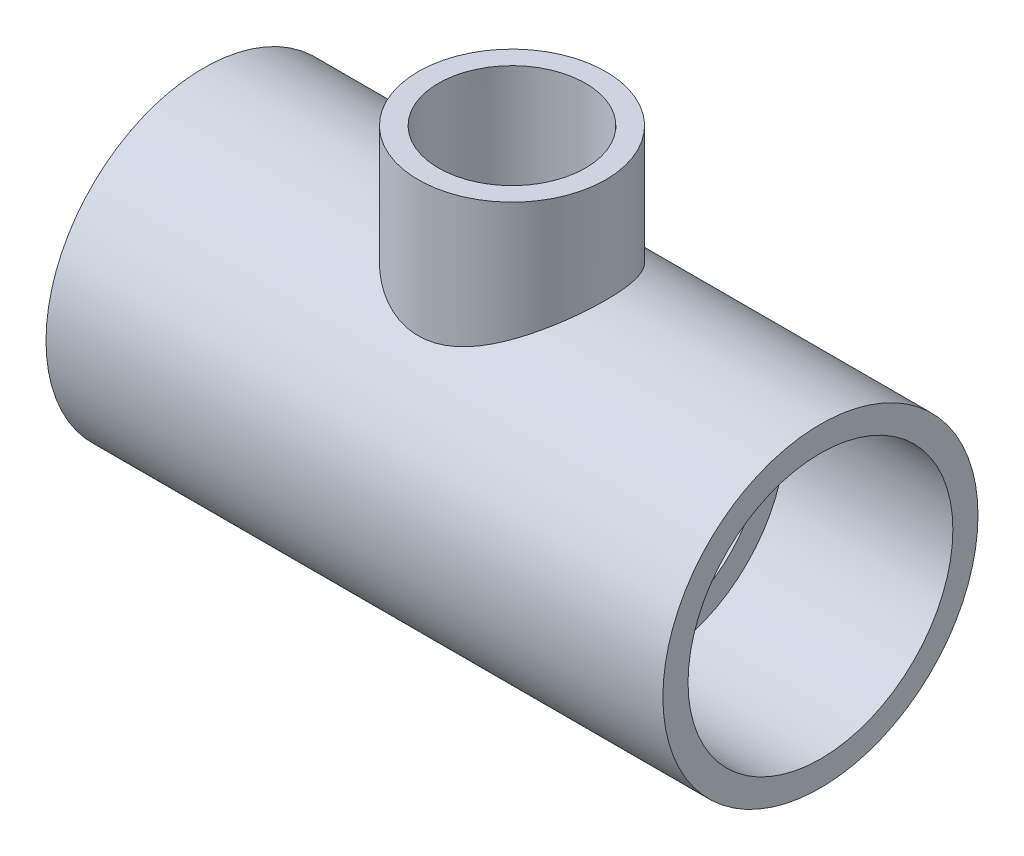
ISO-10303-21;
HEADER;
FILE_DESCRIPTION(('STEP AP214'),'2;1');
FILE_NAME('part.step','',(''),(''),'','','');
FILE_SCHEMA(('AUTOMOTIVE_DESIGN { 1 0 10303 214 1 1 1 1 }'));
ENDSEC;
DATA;
#1=APPLICATION_CONTEXT('core data for automotive mechanical design processes');
#2=APPLICATION_PROTOCOL_DEFINITION('international standard','automotive_design',2000,#1);
#3=PRODUCT_CONTEXT('',#1,'mechanical');
#4=PRODUCT('Part','Part','',(#3));
#5=PRODUCT_RELATED_PRODUCT_CATEGORY('part','',(#4));
#6=PRODUCT_DEFINITION_FORMATION('','',#4);
#7=PRODUCT_DEFINITION_CONTEXT('part definition',#1,'design');
#8=PRODUCT_DEFINITION('design','',#6,#7);
#9=PRODUCT_DEFINITION_SHAPE('','',#8);
#10=(LENGTH_UNIT() NAMED_UNIT(*) SI_UNIT(.MILLI.,.METRE.));
#11=(NAMED_UNIT(*) PLANE_ANGLE_UNIT() SI_UNIT($,.RADIAN.));
#12=(NAMED_UNIT(*) SI_UNIT($,.STERADIAN.) SOLID_ANGLE_UNIT());
#13=UNCERTAINTY_MEASURE_WITH_UNIT(LENGTH_MEASURE(1.E-05),#10,'distance_accuracy_value','');
#14=(GEOMETRIC_REPRESENTATION_CONTEXT(3) GLOBAL_UNCERTAINTY_ASSIGNED_CONTEXT((#13)) GLOBAL_UNIT_ASSIGNED_CONTEXT((#10,
#11,#12)) REPRESENTATION_CONTEXT('',''));
#15=CARTESIAN_POINT('',(0.,0.,0.));
#16=DIRECTION('',(0.,0.,1.));
#17=DIRECTION('',(1.,0.,0.));
#18=AXIS2_PLACEMENT_3D('',#15,#16,#17);
#19=CARTESIAN_POINT('',(-32.512,0.,0.));
#20=DIRECTION('',(1.,0.,0.));
#21=DIRECTION('',(0.,0.,-1.));
#22=AXIS2_PLACEMENT_3D('',#19,#20,#21);
#23=PLANE('',#22);
#24=CARTESIAN_POINT('',(-32.512,0.,0.));
#25=DIRECTION('',(-1.,0.,0.));
#26=DIRECTION('',(0.,0.,1.));
#27=AXIS2_PLACEMENT_3D('',#24,#25,#26);
#28=CIRCLE('',#27,30.0863);
#29=CARTESIAN_POINT('',(-32.512,0.,30.0863));
#30=VERTEX_POINT('',#29);
#31=EDGE_CURVE('E92',#30,#30,#28,.T.);
#32=ORIENTED_EDGE('',*,*,#31,.T.);
#33=EDGE_LOOP('',(#32));
#34=FACE_BOUND('',#33,.T.);
#35=CARTESIAN_POINT('',(-32.512,0.,0.));
#36=DIRECTION('',(1.,0.,0.));
#37=DIRECTION('',(0.,0.,-1.));
#38=AXIS2_PLACEMENT_3D('',#35,#36,#37);
#39=CIRCLE('',#38,24.6253);
#40=CARTESIAN_POINT('',(-32.512,0.,-24.6253));
#41=VERTEX_POINT('',#40);
#42=EDGE_CURVE('E95',#41,#41,#39,.T.);
#43=ORIENTED_EDGE('',*,*,#42,.T.);
#44=EDGE_LOOP('',(#43));
#45=FACE_BOUND('',#44,.T.);
#46=ADVANCED_FACE('F30',(#34,#45),#23,.F.);
#47=CARTESIAN_POINT('',(32.512,0.,0.));
#48=DIRECTION('',(1.,0.,0.));
#49=DIRECTION('',(0.,0.,-1.));
#50=AXIS2_PLACEMENT_3D('',#47,#48,#49);
#51=PLANE('',#50);
#52=CARTESIAN_POINT('',(32.512,0.,0.));
#53=DIRECTION('',(1.,0.,0.));
#54=DIRECTION('',(0.,0.,-1.));
#55=AXIS2_PLACEMENT_3D('',#52,#53,#54);
#56=CIRCLE('',#55,30.0863);
#57=CARTESIAN_POINT('',(32.512,0.,-30.0863));
#58=VERTEX_POINT('',#57);
#59=EDGE_CURVE('E10',#58,#58,#56,.F.);
#60=ORIENTED_EDGE('',*,*,#59,.F.);
#61=EDGE_LOOP('',(#60));
#62=FACE_BOUND('',#61,.T.);
#63=CARTESIAN_POINT('',(32.512,0.,0.));
#64=DIRECTION('',(1.,0.,0.));
#65=DIRECTION('',(0.,0.,-1.));
#66=AXIS2_PLACEMENT_3D('',#63,#64,#65);
#67=CIRCLE('',#66,24.6253);
#68=CARTESIAN_POINT('',(32.512,0.,-24.6253));
#69=VERTEX_POINT('',#68);
#70=EDGE_CURVE('E98',#69,#69,#67,.T.);
#71=ORIENTED_EDGE('',*,*,#70,.F.);
#72=EDGE_LOOP('',(#71));
#73=FACE_BOUND('',#72,.T.);
#74=ADVANCED_FACE('F68',(#62,#73),#51,.T.);
#75=CARTESIAN_POINT('',(32.512,0.,0.));
#76=DIRECTION('',(-1.,0.,0.));
#77=DIRECTION('',(0.,0.,1.));
#78=AXIS2_PLACEMENT_3D('',#75,#76,#77);
#79=CYLINDRICAL_SURFACE('',#78,36.068);
#80=CARTESIAN_POINT('',(-70.612,0.,0.));
#81=DIRECTION('',(-1.,0.,0.));
#82=DIRECTION('',(0.,0.,1.));
#83=AXIS2_PLACEMENT_3D('',#80,#81,#82);
#84=CIRCLE('',#83,36.068);
#85=CARTESIAN_POINT('',(-70.612,0.,36.068));
#86=VERTEX_POINT('',#85);
#87=EDGE_CURVE('E109',#86,#86,#84,.T.);
#88=ORIENTED_EDGE('',*,*,#87,.F.);
#89=EDGE_LOOP('',(#88));
#90=FACE_BOUND('',#89,.T.);
#91=CARTESIAN_POINT('',(70.612,0.,0.));
#92=DIRECTION('',(-1.,0.,0.));
#93=DIRECTION('',(0.,0.,1.));
#94=AXIS2_PLACEMENT_3D('',#91,#92,#93);
#95=CIRCLE('',#94,36.068);
#96=CARTESIAN_POINT('',(70.612,0.,36.068));
#97=VERTEX_POINT('',#96);
#98=EDGE_CURVE('E97',#97,#97,#95,.T.);
#99=ORIENTED_EDGE('',*,*,#98,.T.);
#100=EDGE_LOOP('',(#99));
#101=FACE_BOUND('',#100,.T.);
#102=CARTESIAN_POINT('',(21.463,36.068,0.));
#103=CARTESIAN_POINT('',(21.4629955012336,36.0679958333885,-0.549955186499196));
#104=CARTESIAN_POINT('',(21.4418286946014,36.055389158431,-1.10007080613266));
#105=CARTESIAN_POINT('',(21.3574273305565,36.0052612434909,-2.1961634067197));
#106=CARTESIAN_POINT('',(21.294166931655,35.9677246989503,-2.74213763688238));
#107=CARTESIAN_POINT('',(21.1262441488934,35.8685634583346,-3.8267436334737));
#108=CARTESIAN_POINT('',(21.0214879454157,35.8068841807053,-4.36535588019342));
#109=CARTESIAN_POINT('',(20.7719652680935,35.6609669938344,-5.42998711952681));
#110=CARTESIAN_POINT('',(20.6272045523225,35.5767323311699,-5.95600791266776));
#111=CARTESIAN_POINT('',(20.3002147275364,35.3881510151928,-6.98956407610863));
#112=CARTESIAN_POINT('',(20.11817542982,35.2839064086569,-7.49717833179165));
#113=CARTESIAN_POINT('',(19.7181061781887,35.0573357779405,-8.4938236271323));
#114=CARTESIAN_POINT('',(19.5000750619621,34.9350091698372,-8.98285406602064));
#115=CARTESIAN_POINT('',(19.0301303524284,34.6748877511424,-9.93974477144127));
#116=CARTESIAN_POINT('',(18.7782319940875,34.537099900277,-10.4076144312737));
#117=CARTESIAN_POINT('',(18.2424225324483,34.248726267441,-11.3205381463891));
#118=CARTESIAN_POINT('',(17.9585081587997,34.09813917845,-11.7655898641136));
#119=CARTESIAN_POINT('',(17.3378828067172,33.7752418914906,-12.6640611369192));
#120=CARTESIAN_POINT('',(16.9988019540272,33.6021502073395,-13.1155629319043));
#121=CARTESIAN_POINT('',(16.2878537641754,33.2481487366544,-13.9886807783063));
#122=CARTESIAN_POINT('',(15.915985005189,33.0672386112528,-14.4102955322609));
#123=CARTESIAN_POINT('',(15.1408577335427,32.7012074758686,-15.222692767102));
#124=CARTESIAN_POINT('',(14.7375622391471,32.5160816919732,-15.6134377992391));
#125=CARTESIAN_POINT('',(13.9016081493236,32.1458321409871,-16.3621684571544));
#126=CARTESIAN_POINT('',(13.4689479796909,31.9607083745376,-16.7201523242262));
#127=CARTESIAN_POINT('',(12.5219847775636,31.5726466066888,-17.4429484827564));
#128=CARTESIAN_POINT('',(12.0041216347177,31.3702447153127,-17.8034013560292));
#129=CARTESIAN_POINT('',(10.9353739342683,30.9770204773409,-18.4791153571752));
#130=CARTESIAN_POINT('',(10.3844840804206,30.7861999978954,-18.7943692091844));
#131=CARTESIAN_POINT('',(9.25279599288201,30.4231439624148,-19.3765452159325));
#132=CARTESIAN_POINT('',(8.67203776614753,30.2508844559043,-19.6435299647606));
#133=CARTESIAN_POINT('',(7.48304605482125,29.9317355681574,-20.1264932056783));
#134=CARTESIAN_POINT('',(6.87482270274245,29.7848369256409,-20.3424903280582));
#135=CARTESIAN_POINT('',(5.78267766596031,29.5544638875913,-20.6752239510991));
#136=CARTESIAN_POINT('',(5.30362843446786,29.4642156072466,-20.8033494515604));
#137=CARTESIAN_POINT('',(4.33440470717605,29.3052722481931,-21.0266612249542));
#138=CARTESIAN_POINT('',(3.84423192592826,29.2365738717188,-21.1218525380103));
#139=CARTESIAN_POINT('',(2.85622119516374,29.1231476121112,-21.2779753420956));
#140=CARTESIAN_POINT('',(2.35839172168037,29.0783949450757,-21.3389422587331));
#141=CARTESIAN_POINT('',(1.35802339347409,29.0143994566346,-21.425876631228));
#142=CARTESIAN_POINT('',(0.855484455182277,28.9951570887727,-21.4518434648244));
#143=CARTESIAN_POINT('',(-0.151431251739087,28.982913852612,-21.4683823726771));
#144=CARTESIAN_POINT('',(-0.655809700367673,28.989961652283,-21.4588888031155));
#145=CARTESIAN_POINT('',(-1.6615979173613,29.0301331266113,-21.4045116445106));
#146=CARTESIAN_POINT('',(-2.16300767166571,29.063256924673,-21.3596278879836));
#147=CARTESIAN_POINT('',(-3.15950369915439,29.1543533587243,-21.2351176664531));
#148=CARTESIAN_POINT('',(-3.65458576194051,29.2123417347304,-21.1554691937777));
#149=CARTESIAN_POINT('',(-4.63487269138145,29.3510951647059,-20.9625359174924));
#150=CARTESIAN_POINT('',(-5.12007732769605,29.4318607491859,-20.8492503304276));
#151=CARTESIAN_POINT('',(-6.07236571345055,29.6124596696406,-20.5919215482617));
#152=CARTESIAN_POINT('',(-6.53959406582468,29.7120618951429,-20.4482488813037));
#153=CARTESIAN_POINT('',(-7.45987633545462,29.9280772014045,-20.1307642233393));
#154=CARTESIAN_POINT('',(-7.91292448054736,30.0444970223462,-19.9569401425673));
#155=CARTESIAN_POINT('',(-8.80303782018458,30.291101223135,-19.5806126441224));
#156=CARTESIAN_POINT('',(-9.24010312459196,30.4212855083441,-19.3781094236308));
#157=CARTESIAN_POINT('',(-10.0970318215879,30.6924266021064,-18.9457302598338));
#158=CARTESIAN_POINT('',(-10.5168931325322,30.8333847083899,-18.7158510171599));
#159=CARTESIAN_POINT('',(-11.4091861183347,31.14814133043,-18.1880145139731));
#160=CARTESIAN_POINT('',(-11.8782033736991,31.3234122605326,-17.8851528409649));
#161=CARTESIAN_POINT('',(-12.7896809731185,31.6802823782936,-17.2451326383963));
#162=CARTESIAN_POINT('',(-13.2321390258581,31.8618821098203,-16.9079711564654));
#163=CARTESIAN_POINT('',(-14.0894414521855,32.2273508370409,-16.2005279995394));
#164=CARTESIAN_POINT('',(-14.5042619553269,32.4112216358719,-15.830218325177));
#165=CARTESIAN_POINT('',(-15.3043706957407,32.7770871359483,-15.0580787382223));
#166=CARTESIAN_POINT('',(-15.6896573263291,32.9590817346603,-14.6562471131943));
#167=CARTESIAN_POINT('',(-16.4789068639499,33.3415640264684,-13.7661136694631));
#168=CARTESIAN_POINT('',(-16.8783774662731,33.5412343963679,-13.2734596307647));
#169=CARTESIAN_POINT('',(-17.6342792805926,33.9279029608686,-12.2513910107686));
#170=CARTESIAN_POINT('',(-17.9907060590766,34.1148998492329,-11.7219726515776));
#171=CARTESIAN_POINT('',(-18.6571508326299,34.4710056629587,-10.6292255581115));
#172=CARTESIAN_POINT('',(-18.9671867302025,34.6401214812963,-10.0659100232326));
#173=CARTESIAN_POINT('',(-19.5375041269635,34.95565596253,-8.9085532901237));
#174=CARTESIAN_POINT('',(-19.7977918221917,35.1020774515298,-8.31451592996111));
#175=CARTESIAN_POINT('',(-20.2500694299667,35.3592030837919,-7.1390285064387));
#176=CARTESIAN_POINT('',(-20.4453750337001,35.4715986199873,-6.55922567231934));
#177=CARTESIAN_POINT('',(-20.7866366402843,35.6693868011161,-5.38073619207309));
#178=CARTESIAN_POINT('',(-20.9325941382699,35.7547802641456,-4.78205011866616));
#179=CARTESIAN_POINT('',(-21.1727406332251,35.8959017718609,-3.57152756669138));
#180=CARTESIAN_POINT('',(-21.2669795482166,35.9516584199271,-2.95970436282403));
#181=CARTESIAN_POINT('',(-21.402272412241,36.0318541567467,-1.72819635868767));
#182=CARTESIAN_POINT('',(-21.4433335558085,36.0562974819419,-1.10851263334317));
#183=CARTESIAN_POINT('',(-21.4696834285792,36.0719772778071,0.049618098403805));
#184=CARTESIAN_POINT('',(-21.4616824349449,36.0672091217748,0.587872694205228));
#185=CARTESIAN_POINT('',(-21.4053434734274,36.033712718609,1.66147516389867));
#186=CARTESIAN_POINT('',(-21.3570098345406,36.004987042892,2.19682334353655));
#187=CARTESIAN_POINT('',(-21.2206569043275,35.924274909156,3.2606276273093));
#188=CARTESIAN_POINT('',(-21.1326386081918,35.872289034444,3.78908390393369));
#189=CARTESIAN_POINT('',(-20.9180373557849,35.7462865519787,4.83542344278839));
#190=CARTESIAN_POINT('',(-20.7914533987002,35.6722693724945,5.35330643026019));
#191=CARTESIAN_POINT('',(-20.5043839638669,35.505727200392,6.364006604679));
#192=CARTESIAN_POINT('',(-20.3446977001994,35.4136408557728,6.85712410756646));
#193=CARTESIAN_POINT('',(-19.9914891475949,35.2119139344019,7.82734069640484));
#194=CARTESIAN_POINT('',(-19.7979678212225,35.1022738570391,8.30444023758631));
#195=CARTESIAN_POINT('',(-19.3788072514427,34.8675819749626,9.24041003088048));
#196=CARTESIAN_POINT('',(-19.1531650297491,34.7425287412679,9.69927858754332));
#197=CARTESIAN_POINT('',(-18.6715259411434,34.4793483428168,10.5968843247397));
#198=CARTESIAN_POINT('',(-18.4155271948274,34.3412203686967,11.0356202565069));
#199=CARTESIAN_POINT('',(-17.8467377638358,34.0394224073497,11.9359357804971));
#200=CARTESIAN_POINT('',(-17.5308095546475,33.8745900838003,12.3951448690397));
#201=CARTESIAN_POINT('',(-16.8661343170436,33.5354297034058,13.2854261583916));
#202=CARTESIAN_POINT('',(-16.517385372552,33.3611010924176,13.7164967139808));
#203=CARTESIAN_POINT('',(-15.7885793334125,33.006333508074,14.5494920493151));
#204=CARTESIAN_POINT('',(-15.4084891698965,32.8258882021465,14.9513851806067));
#205=CARTESIAN_POINT('',(-14.6190002679547,32.4627872472857,15.7241971946871));
#206=CARTESIAN_POINT('',(-14.2096000998588,32.2801314908937,16.0951145646401));
#207=CARTESIAN_POINT('',(-13.3090556372117,31.8933447541626,16.8498396075202));
#208=CARTESIAN_POINT('',(-12.8141397725937,31.6894399770902,17.2292773606304));
#209=CARTESIAN_POINT('',(-11.7908701077896,31.2896639482552,17.9450735899609));
#210=CARTESIAN_POINT('',(-11.2625110292388,31.0937939727112,18.2814252404144));
#211=CARTESIAN_POINT('',(-10.1749547656833,30.7166093543593,18.9083117391331));
#212=CARTESIAN_POINT('',(-9.61578509915038,30.5352820671655,19.1988866055344));
#213=CARTESIAN_POINT('',(-8.46875770780185,30.193720133927,19.7317027506019));
#214=CARTESIAN_POINT('',(-7.88090883555296,30.0334790348566,19.973958828071));
#215=CARTESIAN_POINT('',(-6.80974652642561,29.7725453662256,20.3602094057861));
#216=CARTESIAN_POINT('',(-6.33130419536744,29.6664680857042,20.5141246710921));
#217=CARTESIAN_POINT('',(-5.36100339254714,29.4746434754775,20.7887979772916));
#218=CARTESIAN_POINT('',(-4.86914675050901,29.3888933884363,20.9095605156258));
#219=CARTESIAN_POINT('',(-3.8752977497791,29.2406753387526,21.1163382466108));
#220=CARTESIAN_POINT('',(-3.37331769707593,29.1781807162311,21.2023932372691));
#221=CARTESIAN_POINT('',(-2.36198810748157,29.0786193395933,21.3387367821393));
#222=CARTESIAN_POINT('',(-1.85263851458,29.0415527788406,21.3890250643692));
#223=CARTESIAN_POINT('',(-0.828613236838667,28.9942131601922,21.4531547129083));
#224=CARTESIAN_POINT('',(-0.313925206111073,28.98403348246,21.4668690567775));
#225=CARTESIAN_POINT('',(0.714912873702352,28.9911492358534,21.4572580151905));
#226=CARTESIAN_POINT('',(1.22906292149078,29.0084447330865,21.4339325406135));
#227=CARTESIAN_POINT('',(2.25300130085473,29.0698282364911,21.3506056109514));
#228=CARTESIAN_POINT('',(2.76278734862744,29.1139294939753,21.2905860161997));
#229=CARTESIAN_POINT('',(3.77400242770924,29.2272278534621,21.1347820484505));
#230=CARTESIAN_POINT('',(4.27543140144109,29.2964251282928,21.0389974291512));
#231=CARTESIAN_POINT('',(5.24551218550072,29.4539702821916,20.8178249048167));
#232=CARTESIAN_POINT('',(5.71464891805822,29.5413732373454,20.6938772507416));
#233=CARTESIAN_POINT('',(6.64018581174673,29.7342791098689,20.4157266738785));
#234=CARTESIAN_POINT('',(7.09658178407147,29.8397879003117,20.2615139315256));
#235=CARTESIAN_POINT('',(7.99469720969075,30.0660358704942,19.9242394437308));
#236=CARTESIAN_POINT('',(8.43641564795647,30.1867761008102,19.7411757080973));
#237=CARTESIAN_POINT('',(9.30374298054277,30.4405630141982,19.3475470625314));
#238=CARTESIAN_POINT('',(9.72935115251858,30.573610248167,19.1369809213381));
#239=CARTESIAN_POINT('',(10.6277745373016,30.8704283688958,18.6550056825655));
#240=CARTESIAN_POINT('',(11.0977274818961,31.0357706348589,18.3792224338459));
#241=CARTESIAN_POINT('',(12.0131310250016,31.374747716891,17.7943825160109));
#242=CARTESIAN_POINT('',(12.4585853887466,31.5483812509522,17.4853309816764));
#243=CARTESIAN_POINT('',(13.3241539833599,31.9001070637685,16.8350977254087));
#244=CARTESIAN_POINT('',(13.7442470500341,32.078202895671,16.4938897605097));
#245=CARTESIAN_POINT('',(14.5573771249832,32.4349194202356,15.7808611302418));
#246=CARTESIAN_POINT('',(14.9504124744838,32.6135401443776,15.4090385911087));
#247=CARTESIAN_POINT('',(15.7673258348228,32.9954356441719,14.5754440502826));
#248=CARTESIAN_POINT('',(16.1863972148686,33.1981915182252,14.1087037907338));
#249=CARTESIAN_POINT('',(16.9838849397354,33.5942379795887,13.1378346644038));
#250=CARTESIAN_POINT('',(17.3622964292492,33.787527434992,12.633701344539));
#251=CARTESIAN_POINT('',(18.0756684678211,34.1595871176714,11.5900910915508));
#252=CARTESIAN_POINT('',(18.4106089196763,34.3383506152371,11.0505979833897));
#253=CARTESIAN_POINT('',(19.0335327059023,34.6763200141136,9.93934565528037));
#254=CARTESIAN_POINT('',(19.321522272397,34.8355285104054,9.36759073125615));
#255=CARTESIAN_POINT('',(19.8377000395127,35.1245004361445,8.21641669491277));
#256=CARTESIAN_POINT('',(20.0676638151183,35.2551156940327,7.63800944828328));
#257=CARTESIAN_POINT('',(20.4777628810792,35.4901501968142,6.45843868565022));
#258=CARTESIAN_POINT('',(20.6578897416052,35.5945650096691,5.85727133934104));
#259=CARTESIAN_POINT('',(20.9649676139029,35.7736581311565,4.63935791016681));
#260=CARTESIAN_POINT('',(21.0920951010935,35.8484350851977,4.0226708976899));
#261=CARTESIAN_POINT('',(21.2917908643984,35.9662904914895,2.77789432053145));
#262=CARTESIAN_POINT('',(21.3644055694982,36.0093959179738,2.14981492691807));
#263=CARTESIAN_POINT('',(21.4270916403961,36.0466417204811,1.26665693209297));
#264=CARTESIAN_POINT('',(21.4405511678771,36.0546452483863,1.01359728521445));
#265=CARTESIAN_POINT('',(21.4585065023745,36.0653254185212,0.507036465507004));
#266=CARTESIAN_POINT('',(21.4630020739799,36.0680019208529,0.253535281257442));
#267=CARTESIAN_POINT('',(21.463,36.068,0.));
#268=B_SPLINE_CURVE_WITH_KNOTS('',3,(#102,#103,#104,#105,#106,#107,#108,#109,#110,#111,#112,
#113,#114,#115,#116,#117,#118,#119,#120,#121,#122,#123,#124,#125,#126,#127,#128,#129,#130,#131,
#132,#133,#134,#135,#136,#137,#138,#139,#140,#141,#142,#143,#144,#145,#146,#147,#148,#149,#150,
#151,#152,#153,#154,#155,#156,#157,#158,#159,#160,#161,#162,#163,#164,#165,#166,#167,#168,#169,
#170,#171,#172,#173,#174,#175,#176,#177,#178,#179,#180,#181,#182,#183,#184,#185,#186,#187,#188,
#189,#190,#191,#192,#193,#194,#195,#196,#197,#198,#199,#200,#201,#202,#203,#204,#205,#206,#207,
#208,#209,#210,#211,#212,#213,#214,#215,#216,#217,#218,#219,#220,#221,#222,#223,#224,#225,#226,
#227,#228,#229,#230,#231,#232,#233,#234,#235,#236,#237,#238,#239,#240,#241,#242,#243,#244,#245,
#246,#247,#248,#249,#250,#251,#252,#253,#254,#255,#256,#257,#258,#259,#260,#261,#262,#263,#264,
#265,#266,#267),.UNSPECIFIED.,.T.,.F.,(4,2,2,2,2,2,2,2,2,2,2,2,2,2,2,2,2,2,2,2,2,2,2,2,2,2,2,2,
2,2,2,2,2,2,2,2,2,2,2,2,2,2,2,2,2,2,2,2,2,2,2,2,2,2,2,2,2,2,2,2,2,2,2,2,2,2,2,2,2,2,2,2,2,2,2,2,
2,2,2,2,2,2,4),(0.,1.64959642123134,3.30020647428807,4.95456995953005,6.60869544688477,
8.25459917957968,9.90055607512477,11.545775009297,13.1911621506759,14.9611285437609,
16.731171727984,18.5033302309237,20.2755838123023,22.2610417990428,24.246819034782,
26.2300024023474,28.212460012047,29.7230441594288,31.2333970303623,32.7421836414886,
34.2509970767413,35.7626049900595,37.2742200570911,38.7867934373493,40.2994020502981,
41.7945325471141,43.2902639357673,44.7859850411254,46.281886594135,48.0356577730855,
49.7895800365629,51.5449980273508,53.3005114476708,55.2928494841009,57.2853925565682,
59.2771647011972,61.2686886126699,63.1321403432166,64.9955356103733,66.8571291782575,
68.7184708608382,70.3314703923341,71.9442968191064,73.5570828025289,75.1699106427546,
76.747578706329,78.3252018945486,79.902971457188,81.4808387522245,83.2228244603146,
84.9649119287718,86.7088616312856,88.4528964574088,90.4189475978552,92.3853098189701,
94.3499433883025,96.3139743137692,97.853458195715,99.3927331306662,100.930237976762,
102.467754514431,104.010603983338,105.553457164467,107.097073669463,108.640700805032,
110.118351844899,111.596483106396,113.074716376611,114.553015848855,116.259649144078,
117.966019406294,119.673794505045,121.381674205941,123.356970202516,125.332501812988,
127.308943507521,129.285122640953,131.19036352073,133.095926472014,134.995092667564,
136.892639486728,137.653101283912,138.413583052037),.UNSPECIFIED.);
#269=CARTESIAN_POINT('',(21.463,36.068,0.));
#270=VERTEX_POINT('',#269);
#271=EDGE_CURVE('E52',#270,#270,#268,.T.);
#272=ORIENTED_EDGE('',*,*,#271,.F.);
#273=EDGE_LOOP('',(#272));
#274=FACE_BOUND('',#273,.T.);
#275=ADVANCED_FACE('F64',(#90,#101,#274),#79,.T.);
#276=CARTESIAN_POINT('',(0.,0.,0.));
#277=DIRECTION('',(0.,-1.,0.));
#278=DIRECTION('',(1.,0.,0.));
#279=AXIS2_PLACEMENT_3D('',#276,#277,#278);
#280=CYLINDRICAL_SURFACE('',#279,21.463);
#281=CARTESIAN_POINT('',(0.,59.944,0.));
#282=DIRECTION('',(0.,-1.,0.));
#283=DIRECTION('',(1.,0.,0.));
#284=AXIS2_PLACEMENT_3D('',#281,#282,#283);
#285=CIRCLE('',#284,21.463);
#286=CARTESIAN_POINT('',(21.463,59.944,0.));
#287=VERTEX_POINT('',#286);
#288=EDGE_CURVE('E43',#287,#287,#285,.T.);
#289=ORIENTED_EDGE('',*,*,#288,.T.);
#290=EDGE_LOOP('',(#289));
#291=FACE_BOUND('',#290,.T.);
#292=ORIENTED_EDGE('',*,*,#271,.T.);
#293=EDGE_LOOP('',(#292));
#294=FACE_BOUND('',#293,.T.);
#295=ADVANCED_FACE('F61',(#291,#294),#280,.T.);
#296=CARTESIAN_POINT('',(0.,59.944,0.));
#297=DIRECTION('',(0.,1.,0.));
#298=DIRECTION('',(-1.,0.,0.));
#299=AXIS2_PLACEMENT_3D('',#296,#297,#298);
#300=CONICAL_SURFACE('',#299,16.8275,0.00666656790386822);
#301=CARTESIAN_POINT('',(0.,59.944,0.));
#302=DIRECTION('',(0.,-1.,0.));
#303=DIRECTION('',(1.,0.,0.));
#304=AXIS2_PLACEMENT_3D('',#301,#302,#303);
#305=CIRCLE('',#304,16.8275);
#306=CARTESIAN_POINT('',(16.8275,59.944,0.));
#307=VERTEX_POINT('',#306);
#308=EDGE_CURVE('E47',#307,#307,#305,.T.);
#309=ORIENTED_EDGE('',*,*,#308,.F.);
#310=EDGE_LOOP('',(#309));
#311=FACE_BOUND('',#310,.T.);
#312=CARTESIAN_POINT('',(0.,31.369,0.));
#313=DIRECTION('',(0.,-1.,0.));
#314=DIRECTION('',(1.,0.,0.));
#315=AXIS2_PLACEMENT_3D('',#312,#313,#314);
#316=CIRCLE('',#315,16.637);
#317=CARTESIAN_POINT('',(16.637,31.369,0.));
#318=VERTEX_POINT('',#317);
#319=EDGE_CURVE('E152',#318,#318,#316,.T.);
#320=ORIENTED_EDGE('',*,*,#319,.T.);
#321=EDGE_LOOP('',(#320));
#322=FACE_BOUND('',#321,.T.);
#323=ADVANCED_FACE('F71',(#311,#322),#300,.F.);
#324=CARTESIAN_POINT('',(21.463,59.944,0.));
#325=DIRECTION('',(0.,1.,0.));
#326=DIRECTION('',(-1.,0.,0.));
#327=AXIS2_PLACEMENT_3D('',#324,#325,#326);
#328=PLANE('',#327);
#329=ORIENTED_EDGE('',*,*,#308,.T.);
#330=EDGE_LOOP('',(#329));
#331=FACE_BOUND('',#330,.T.);
#332=ORIENTED_EDGE('',*,*,#288,.F.);
#333=EDGE_LOOP('',(#332));
#334=FACE_BOUND('',#333,.T.);
#335=ADVANCED_FACE('F32',(#331,#334),#328,.T.);
#336=CARTESIAN_POINT('',(-70.612,-36.068,0.));
#337=DIRECTION('',(-1.,0.,0.));
#338=DIRECTION('',(0.,0.,1.));
#339=AXIS2_PLACEMENT_3D('',#336,#337,#338);
#340=PLANE('',#339);
#341=ORIENTED_EDGE('',*,*,#87,.T.);
#342=EDGE_LOOP('',(#341));
#343=FACE_BOUND('',#342,.T.);
#344=CARTESIAN_POINT('',(-70.612,0.,0.));
#345=DIRECTION('',(-1.,0.,0.));
#346=DIRECTION('',(0.,0.,1.));
#347=AXIS2_PLACEMENT_3D('',#344,#345,#346);
#348=CIRCLE('',#347,30.3149);
#349=CARTESIAN_POINT('',(-70.612,0.,30.3149));
#350=VERTEX_POINT('',#349);
#351=EDGE_CURVE('E59',#350,#350,#348,.T.);
#352=ORIENTED_EDGE('',*,*,#351,.F.);
#353=EDGE_LOOP('',(#352));
#354=FACE_BOUND('',#353,.T.);
#355=ADVANCED_FACE('F78',(#343,#354),#340,.T.);
#356=CARTESIAN_POINT('',(-32.512,0.,0.));
#357=DIRECTION('',(-1.,0.,0.));
#358=DIRECTION('',(0.,0.,1.));
#359=AXIS2_PLACEMENT_3D('',#356,#357,#358);
#360=CONICAL_SURFACE('',#359,30.0863,0.00599992800155504);
#361=ORIENTED_EDGE('',*,*,#351,.T.);
#362=EDGE_LOOP('',(#361));
#363=FACE_BOUND('',#362,.T.);
#364=ORIENTED_EDGE('',*,*,#31,.F.);
#365=EDGE_LOOP('',(#364));
#366=FACE_BOUND('',#365,.T.);
#367=ADVANCED_FACE('F114',(#363,#366),#360,.F.);
#368=CARTESIAN_POINT('',(70.612,-36.068,0.));
#369=DIRECTION('',(1.,0.,0.));
#370=DIRECTION('',(0.,0.,-1.));
#371=AXIS2_PLACEMENT_3D('',#368,#369,#370);
#372=PLANE('',#371);
#373=CARTESIAN_POINT('',(70.612,0.,0.));
#374=DIRECTION('',(-1.,0.,0.));
#375=DIRECTION('',(0.,0.,1.));
#376=AXIS2_PLACEMENT_3D('',#373,#374,#375);
#377=CIRCLE('',#376,30.3149);
#378=CARTESIAN_POINT('',(70.612,0.,30.3149));
#379=VERTEX_POINT('',#378);
#380=EDGE_CURVE('E101',#379,#379,#377,.T.);
#381=ORIENTED_EDGE('',*,*,#380,.T.);
#382=EDGE_LOOP('',(#381));
#383=FACE_BOUND('',#382,.T.);
#384=ORIENTED_EDGE('',*,*,#98,.F.);
#385=EDGE_LOOP('',(#384));
#386=FACE_BOUND('',#385,.T.);
#387=ADVANCED_FACE('F123',(#383,#386),#372,.T.);
#388=CARTESIAN_POINT('',(70.612,0.,0.));
#389=DIRECTION('',(1.,0.,0.));
#390=DIRECTION('',(0.,0.,-1.));
#391=AXIS2_PLACEMENT_3D('',#388,#389,#390);
#392=CONICAL_SURFACE('',#391,30.3149,0.00599992800155476);
#393=ORIENTED_EDGE('',*,*,#59,.T.);
#394=EDGE_LOOP('',(#393));
#395=FACE_BOUND('',#394,.T.);
#396=ORIENTED_EDGE('',*,*,#380,.F.);
#397=EDGE_LOOP('',(#396));
#398=FACE_BOUND('',#397,.T.);
#399=ADVANCED_FACE('F128',(#395,#398),#392,.F.);
#400=CARTESIAN_POINT('',(70.612,0.,0.));
#401=DIRECTION('',(1.,0.,0.));
#402=DIRECTION('',(0.,0.,-1.));
#403=AXIS2_PLACEMENT_3D('',#400,#401,#402);
#404=CYLINDRICAL_SURFACE('',#403,24.6253);
#405=CARTESIAN_POINT('',(12.1539,24.6253,0.));
#406=CARTESIAN_POINT('',(12.1538986312568,24.6252987650347,0.320114178524642));
#407=CARTESIAN_POINT('',(12.1412382413539,24.6190432161801,0.640258063430902));
#408=CARTESIAN_POINT('',(12.0907381726852,24.5941779795407,1.27819442469049));
#409=CARTESIAN_POINT('',(12.0528871175017,24.5755627099613,1.59598577301392));
#410=CARTESIAN_POINT('',(11.9523627612011,24.5264177109645,2.22724838213215));
#411=CARTESIAN_POINT('',(11.8896462991422,24.4958672660334,2.54071114518304));
#412=CARTESIAN_POINT('',(11.7401152241507,24.423638957626,3.16047392385005));
#413=CARTESIAN_POINT('',(11.6533031309545,24.3819622576656,3.46677468478416));
#414=CARTESIAN_POINT('',(11.4568744194706,24.2886938482662,4.06906208873458));
#415=CARTESIAN_POINT('',(11.3473474640476,24.2371411817115,4.36508409688443));
#416=CARTESIAN_POINT('',(11.1063181971349,24.1252363564597,4.94630888249109));
#417=CARTESIAN_POINT('',(10.9748153870684,24.0648839981239,5.23151141430115));
#418=CARTESIAN_POINT('',(10.6909908940403,23.9367786955632,5.78946762746817));
#419=CARTESIAN_POINT('',(10.5386772275881,23.8690286030134,6.06222604869058));
#420=CARTESIAN_POINT('',(10.2142450352558,23.7275704558196,6.59420940587793));
#421=CARTESIAN_POINT('',(10.0421187060097,23.6538600570881,6.85342895061767));
#422=CARTESIAN_POINT('',(9.66844990046735,23.4975861438967,7.37200473174956));
#423=CARTESIAN_POINT('',(9.46576937653759,23.4147568554692,7.630461087465));
#424=CARTESIAN_POINT('',(9.04070030474024,23.2461676915869,8.12960619594425));
#425=CARTESIAN_POINT('',(8.81831066349245,23.1604076537085,8.37029396162088));
#426=CARTESIAN_POINT('',(8.35487339425129,22.9879477912489,8.83292928905042));
#427=CARTESIAN_POINT('',(8.11381454433815,22.9012474287943,9.0548654091115));
#428=CARTESIAN_POINT('',(7.61427053071943,22.7290617927047,9.47879264097936));
#429=CARTESIAN_POINT('',(7.35578214417815,22.6435767473477,9.68078004702595));
#430=CARTESIAN_POINT('',(6.8024578583363,22.4697013160013,10.0781164642344));
#431=CARTESIAN_POINT('',(6.50635086931858,22.3815777302221,10.2718171048174));
#432=CARTESIAN_POINT('',(5.89704848604793,22.2121076417936,10.6333216246707));
#433=CARTESIAN_POINT('',(5.5838604018408,22.1307582771243,10.8011364661574));
#434=CARTESIAN_POINT('',(4.94214564188663,21.9776225921375,11.1094166449154));
#435=CARTESIAN_POINT('',(4.61362352420293,21.9058334541703,11.2498900460849));
#436=CARTESIAN_POINT('',(3.94331492440804,21.7745243182392,11.501987793676));
#437=CARTESIAN_POINT('',(3.60152987819474,21.7150029964915,11.6136152531082));
#438=CARTESIAN_POINT('',(2.92781898938335,21.6137916291862,11.8008503042905));
#439=CARTESIAN_POINT('',(2.59650406100708,21.5712557215463,11.8781966294069));
#440=CARTESIAN_POINT('',(1.9270195161739,21.5009479031137,12.0049956883984));
#441=CARTESIAN_POINT('',(1.58885018648424,21.4731753759844,12.0544495867226));
#442=CARTESIAN_POINT('',(0.908887274935018,21.4335974210286,12.124682914039));
#443=CARTESIAN_POINT('',(0.567096845138541,21.4217790988901,12.14548549952));
#444=CARTESIAN_POINT('',(-0.1171786202825,21.4145943003547,12.1581503279863));
#445=CARTESIAN_POINT('',(-0.459663589768432,21.4192263247831,12.1500152081607));
#446=CARTESIAN_POINT('',(-1.10250021393271,21.4432430012946,12.1075680507964));
#447=CARTESIAN_POINT('',(-1.40313269948097,21.4608548024013,12.0764006146484));
#448=CARTESIAN_POINT('',(-2.00028449128115,21.5081538910242,11.9919581218365));
#449=CARTESIAN_POINT('',(-2.29680416803996,21.5378400834027,11.9386850701252));
#450=CARTESIAN_POINT('',(-2.88386908951041,21.6083281694366,11.8106257714636));
#451=CARTESIAN_POINT('',(-3.1744128928514,21.6491327117754,11.735834398045));
#452=CARTESIAN_POINT('',(-3.74776058872866,21.7406004659133,11.5655100938971));
#453=CARTESIAN_POINT('',(-4.03056407701773,21.7912641915034,11.4699760821774));
#454=CARTESIAN_POINT('',(-4.59336981555706,21.9022668518668,11.25659322219));
#455=CARTESIAN_POINT('',(-4.87315727992805,21.9628018653665,11.1382808160817));
#456=CARTESIAN_POINT('',(-5.42185617297947,22.0910261351279,10.8817518556418));
#457=CARTESIAN_POINT('',(-5.69076366103169,22.1587179520073,10.7435281708402));
#458=CARTESIAN_POINT('',(-6.21651349382246,22.2995288507426,10.4481185702969));
#459=CARTESIAN_POINT('',(-6.47335391754384,22.3726487919811,10.2909296494991));
#460=CARTESIAN_POINT('',(-6.97394476249433,22.5225881637373,9.95849747948221));
#461=CARTESIAN_POINT('',(-7.21769415675791,22.5994078836015,9.78325281696366));
#462=CARTESIAN_POINT('',(-7.72042068977971,22.7646634847339,9.39285817893441));
#463=CARTESIAN_POINT('',(-7.97756347698787,22.853362737904,9.17545256669474));
#464=CARTESIAN_POINT('',(-8.47281209316128,23.0309190579252,8.72019730832514));
#465=CARTESIAN_POINT('',(-8.71092457677594,23.1197760584051,8.48235486959517));
#466=CARTESIAN_POINT('',(-9.16715732378071,23.2955045281305,7.98711168108278));
#467=CARTESIAN_POINT('',(-9.38526020878381,23.3823742231604,7.72969427864226));
#468=CARTESIAN_POINT('',(-9.79983170718248,23.5518373004272,7.19683877612552));
#469=CARTESIAN_POINT('',(-9.99630897140204,23.6344323855652,6.921407952705));
#470=CARTESIAN_POINT('',(-10.3745940586159,23.7968452018055,6.34115879318834));
#471=CARTESIAN_POINT('',(-10.5553588378578,23.8763754101898,6.03557795628665));
#472=CARTESIAN_POINT('',(-10.8902526696275,24.0263041855226,5.40797428544881));
#473=CARTESIAN_POINT('',(-11.0443805342803,24.0967023451919,5.08595071907723));
#474=CARTESIAN_POINT('',(-11.3242752822375,24.2262655123307,4.42784862009045));
#475=CARTESIAN_POINT('',(-11.4500597753547,24.2854374910244,4.09177896908719));
#476=CARTESIAN_POINT('',(-11.6718509241824,24.390790936426,3.4079801238119));
#477=CARTESIAN_POINT('',(-11.7678609063041,24.4369738542193,3.0602522368124));
#478=CARTESIAN_POINT('',(-11.9222576645455,24.5117150151044,2.38477153507107));
#479=CARTESIAN_POINT('',(-11.9830708224134,24.5414019056426,2.05769679897572));
#480=CARTESIAN_POINT('',(-12.0777289916076,24.5877599761911,1.39875414846854));
#481=CARTESIAN_POINT('',(-12.111575446701,24.6044318530096,1.06688649163303));
#482=CARTESIAN_POINT('',(-12.1518499268717,24.6242820281521,0.401217727105967));
#483=CARTESIAN_POINT('',(-12.1582885158992,24.6274655253672,0.0674174140127415));
#484=CARTESIAN_POINT('',(-12.1436888997489,24.6202609788179,-0.599427310972225));
#485=CARTESIAN_POINT('',(-12.1226518506439,24.6098735060697,-0.932471754077532));
#486=CARTESIAN_POINT('',(-12.0559953464293,24.5771108674547,-1.57008370227872));
#487=CARTESIAN_POINT('',(-12.0123437152007,24.5556960454347,-1.87490908966849));
#488=CARTESIAN_POINT('',(-11.9022726587381,24.5020386743099,-2.47942949710625));
#489=CARTESIAN_POINT('',(-11.8358546528312,24.4697968001999,-2.77912483575493));
#490=CARTESIAN_POINT('',(-11.6809325199016,24.395239150544,-3.37147366546162));
#491=CARTESIAN_POINT('',(-11.5924271390195,24.352922803095,-3.66412675570978));
#492=CARTESIAN_POINT('',(-11.3941729069205,24.2591769375298,-4.24064137301293));
#493=CARTESIAN_POINT('',(-11.2844231698483,24.2077470394007,-4.52450253288588));
#494=CARTESIAN_POINT('',(-11.0411614751859,24.0952982047236,-5.08993910366291));
#495=CARTESIAN_POINT('',(-10.9070549695976,24.0340452957756,-5.37121192624128));
#496=CARTESIAN_POINT('',(-10.6183877568749,23.9044271881525,-5.92146075517204));
#497=CARTESIAN_POINT('',(-10.4638197303178,23.8360594462652,-6.19043231461636));
#498=CARTESIAN_POINT('',(-10.1353224714466,23.6936903845811,-6.71477909009701));
#499=CARTESIAN_POINT('',(-9.96138934965467,23.6196879340004,-6.97015155947591));
#500=CARTESIAN_POINT('',(-9.59526307288053,23.4676257873859,-7.46613906047251));
#501=CARTESIAN_POINT('',(-9.40307046080738,23.3895662120136,-7.70675453050998));
#502=CARTESIAN_POINT('',(-8.98207070233843,23.2233671679413,-8.19471086814885));
#503=CARTESIAN_POINT('',(-8.75151993466959,23.1349811902591,-8.44046572501328));
#504=CARTESIAN_POINT('',(-8.2709654247324,22.9575069974441,-8.91188665240519));
#505=CARTESIAN_POINT('',(-8.02096087057482,22.8684187531423,-9.13755188366359));
#506=CARTESIAN_POINT('',(-7.50259819945127,22.6917979464339,-9.56774829223574));
#507=CARTESIAN_POINT('',(-7.23422950645393,22.6042663176761,-9.77226711803819));
#508=CARTESIAN_POINT('',(-6.68050737085725,22.4331887823971,-10.158845206108));
#509=CARTESIAN_POINT('',(-6.39515154712237,22.3496434376159,-10.3409013086684));
#510=CARTESIAN_POINT('',(-5.79551419659604,22.1853386454617,-10.689007051658));
#511=CARTESIAN_POINT('',(-5.48050739882067,22.1048785989912,-10.8539524910162));
#512=CARTESIAN_POINT('',(-4.83542565073554,21.9538428323377,-11.1562875395211));
#513=CARTESIAN_POINT('',(-4.50535802779906,21.8832623721271,-11.2936903768226));
#514=CARTESIAN_POINT('',(-3.83245693417897,21.7546983699641,-11.5393992652425));
#515=CARTESIAN_POINT('',(-3.48963364711357,21.6967050214352,-11.6477279835894));
#516=CARTESIAN_POINT('',(-2.79366866416196,21.595700172324,-11.8339511071783));
#517=CARTESIAN_POINT('',(-2.44052852402596,21.552686425374,-11.9118500759333));
#518=CARTESIAN_POINT('',(-1.76105262409205,21.486883868821,-12.0301013526203));
#519=CARTESIAN_POINT('',(-1.43536259402673,21.4625603791776,-12.0733204050605));
#520=CARTESIAN_POINT('',(-0.780787248123778,21.4287415322203,-12.1332452481024));
#521=CARTESIAN_POINT('',(-0.451902148196845,21.4192451798623,-12.149952817882));
#522=CARTESIAN_POINT('',(0.206110398473082,21.4154705668296,-12.1566044715006));
#523=CARTESIAN_POINT('',(0.535237724744981,21.4211871313369,-12.1465576560967));
#524=CARTESIAN_POINT('',(1.19098300529215,21.4475928556901,-12.0998710052953));
#525=CARTESIAN_POINT('',(1.51760105223868,21.4682814598848,-12.063232156797));
#526=CARTESIAN_POINT('',(2.13609604030905,21.5212651017409,-11.9684244910369));
#527=CARTESIAN_POINT('',(2.42842978011262,21.5523326827124,-11.9125182135223));
#528=CARTESIAN_POINT('',(3.00704097123434,21.62517074006,-11.7797758619681));
#529=CARTESIAN_POINT('',(3.2933163771039,21.6669447707116,-11.7029328369127));
#530=CARTESIAN_POINT('',(3.85808456118912,21.7599477606783,-11.5290839817338));
#531=CARTESIAN_POINT('',(4.13657727519447,21.8111767979745,-11.4320779853135));
#532=CARTESIAN_POINT('',(4.68441879992306,21.9216761993368,-11.2187314723129));
#533=CARTESIAN_POINT('',(4.95376672557089,21.9809473389971,-11.1023890906544));
#534=CARTESIAN_POINT('',(5.49988341210589,22.110219147884,-10.84278636988));
#535=CARTESIAN_POINT('',(5.77593463409005,22.1806731716521,-10.6982425719443));
#536=CARTESIAN_POINT('',(6.31503798463156,22.3271247786689,-10.389135690281));
#537=CARTESIAN_POINT('',(6.57808971253684,22.4031225326,-10.2245719900686));
#538=CARTESIAN_POINT('',(7.09021755173163,22.558806729553,-9.87633638207174));
#539=CARTESIAN_POINT('',(7.33928842080856,22.638494536014,-9.69265737958832));
#540=CARTESIAN_POINT('',(7.82238587209191,22.7996923433324,-9.30715244789975));
#541=CARTESIAN_POINT('',(8.05641020721906,22.8812026139217,-9.10532381893914));
#542=CARTESIAN_POINT('',(8.53500054356727,23.0538249166505,-8.65968519371511));
#543=CARTESIAN_POINT('',(8.77757253765335,23.1449394490207,-8.41372908631081));
#544=CARTESIAN_POINT('',(9.24122820968092,23.3247242025735,-7.90166120867295));
#545=CARTESIAN_POINT('',(9.46231865764737,23.4133951875009,-7.63555583593932));
#546=CARTESIAN_POINT('',(9.88183844513112,23.5860609105346,-7.08425146160509));
#547=CARTESIAN_POINT('',(10.0802500108162,23.6700519548266,-6.79903775838097));
#548=CARTESIAN_POINT('',(10.4526904998496,23.83104388027,-6.21124643633144));
#549=CARTESIAN_POINT('',(10.626720897565,23.9080451840025,-5.90866986902644));
#550=CARTESIAN_POINT('',(10.9495686177761,24.0532801554627,-5.2865466917374));
#551=CARTESIAN_POINT('',(11.0982717184799,24.1214737848542,-4.96693131690644));
#552=CARTESIAN_POINT('',(11.3679863145902,24.246751420602,-4.31403796588803));
#553=CARTESIAN_POINT('',(11.4889938036285,24.303833819461,-3.98075802123472));
#554=CARTESIAN_POINT('',(11.7015646798476,24.4050407544192,-3.30396152494423));
#555=CARTESIAN_POINT('',(11.7932022857728,24.4491979281154,-2.9604732119834));
#556=CARTESIAN_POINT('',(11.9461841356969,24.5233548664533,-2.26548825851572));
#557=CARTESIAN_POINT('',(12.0075471951851,24.5533634238783,-1.91399673444663));
#558=CARTESIAN_POINT('',(12.0867866631611,24.5922288224758,-1.30182102429258));
#559=CARTESIAN_POINT('',(12.1119344371573,24.6046105979493,-1.04227460146801));
#560=CARTESIAN_POINT('',(12.1454918908739,24.6211468018266,-0.521825388939201));
#561=CARTESIAN_POINT('',(12.1539011156519,24.6253010066105,-0.260922562562054));
#562=CARTESIAN_POINT('',(12.1539,24.6253,0.));
#563=B_SPLINE_CURVE_WITH_KNOTS('',3,(#405,#406,#407,#408,#409,#410,#411,#412,#413,#414,#415,
#416,#417,#418,#419,#420,#421,#422,#423,#424,#425,#426,#427,#428,#429,#430,#431,#432,#433,#434,
#435,#436,#437,#438,#439,#440,#441,#442,#443,#444,#445,#446,#447,#448,#449,#450,#451,#452,#453,
#454,#455,#456,#457,#458,#459,#460,#461,#462,#463,#464,#465,#466,#467,#468,#469,#470,#471,#472,
#473,#474,#475,#476,#477,#478,#479,#480,#481,#482,#483,#484,#485,#486,#487,#488,#489,#490,#491,
#492,#493,#494,#495,#496,#497,#498,#499,#500,#501,#502,#503,#504,#505,#506,#507,#508,#509,#510,
#511,#512,#513,#514,#515,#516,#517,#518,#519,#520,#521,#522,#523,#524,#525,#526,#527,#528,#529,
#530,#531,#532,#533,#534,#535,#536,#537,#538,#539,#540,#541,#542,#543,#544,#545,#546,#547,#548,
#549,#550,#551,#552,#553,#554,#555,#556,#557,#558,#559,#560,#561,#562),.UNSPECIFIED.,.T.,.F.,(4,
2,2,2,2,2,2,2,2,2,2,2,2,2,2,2,2,2,2,2,2,2,2,2,2,2,2,2,2,2,2,2,2,2,2,2,2,2,2,2,2,2,2,2,2,2,2,2,2,
2,2,2,2,2,2,2,2,2,2,2,2,2,2,2,2,2,2,2,2,2,2,2,2,2,2,2,2,2,4),(0.,0.960084795046651,
1.92060347081879,2.88279674925899,3.84488944678124,4.80325437145745,5.76164104196636,
6.71965956961187,7.67805671952992,8.6931753467164,9.70835032377292,10.7241403229235,
11.7401186661261,12.8326882160168,13.9247938025779,15.0165768012521,16.1082419270994,
17.1353966889799,18.1625085661775,19.1887898256172,20.2149775590361,21.12217824129,
22.029296659516,22.9366313664395,23.84401336993,24.7723084169376,25.7009367279101,
26.6297123744644,27.5585607755357,28.6020651718287,29.6452030569465,30.6892384992584,
31.73285476997,32.8229502371793,33.9130943047301,35.0025591837729,36.0919023038149,
37.0925723450361,38.0931888078987,39.0934195632362,40.0936082339308,41.0185732867907,
41.9434806849182,42.8684406002742,43.7934390932748,44.7451426411249,45.6971875536113,
46.6494240303705,47.6016322031541,48.6455926419525,49.6895966730498,50.734207097279,
51.7789642939603,52.8712260369951,53.9629619252134,55.0538441679449,56.1445627495151,
57.1315263464725,58.1184237057904,59.1049854055225,60.0915104932653,60.9882650766816,
61.8853177468342,62.782377815846,63.6795244604536,64.636955833602,65.5944166969687,
66.552234200678,67.5101944160846,68.5807506017436,69.6509682939784,70.72201906531,
71.793005040559,72.868699951504,73.9445503712004,75.0176602409411,76.0901023351234,
76.8726386720053,77.6551962774041),.UNSPECIFIED.);
#564=CARTESIAN_POINT('',(12.1539,24.6253,0.));
#565=VERTEX_POINT('',#564);
#566=EDGE_CURVE('E34',#565,#565,#563,.T.);
#567=ORIENTED_EDGE('',*,*,#566,.F.);
#568=EDGE_LOOP('',(#567));
#569=FACE_BOUND('',#568,.T.);
#570=ORIENTED_EDGE('',*,*,#70,.T.);
#571=EDGE_LOOP('',(#570));
#572=FACE_BOUND('',#571,.T.);
#573=ORIENTED_EDGE('',*,*,#42,.F.);
#574=EDGE_LOOP('',(#573));
#575=FACE_BOUND('',#574,.T.);
#576=ADVANCED_FACE('F131',(#569,#572,#575),#404,.F.);
#577=CARTESIAN_POINT('',(16.637,31.369,0.));
#578=DIRECTION('',(0.,-1.,0.));
#579=DIRECTION('',(1.,0.,0.));
#580=AXIS2_PLACEMENT_3D('',#577,#578,#579);
#581=PLANE('',#580);
#582=ORIENTED_EDGE('',*,*,#319,.F.);
#583=EDGE_LOOP('',(#582));
#584=FACE_BOUND('',#583,.T.);
#585=CARTESIAN_POINT('',(0.,31.369,0.));
#586=DIRECTION('',(0.,-1.,0.));
#587=DIRECTION('',(1.,0.,0.));
#588=AXIS2_PLACEMENT_3D('',#585,#586,#587);
#589=CIRCLE('',#588,12.1539);
#590=CARTESIAN_POINT('',(12.1539,31.369,0.));
#591=VERTEX_POINT('',#590);
#592=EDGE_CURVE('E150',#591,#591,#589,.T.);
#593=ORIENTED_EDGE('',*,*,#592,.T.);
#594=EDGE_LOOP('',(#593));
#595=FACE_BOUND('',#594,.T.);
#596=ADVANCED_FACE('F135',(#584,#595),#581,.F.);
#597=CARTESIAN_POINT('',(0.,0.,0.));
#598=DIRECTION('',(0.,-1.,0.));
#599=DIRECTION('',(1.,0.,0.));
#600=AXIS2_PLACEMENT_3D('',#597,#598,#599);
#601=CYLINDRICAL_SURFACE('',#600,12.1539);
#602=ORIENTED_EDGE('',*,*,#566,.T.);
#603=EDGE_LOOP('',(#602));
#604=FACE_BOUND('',#603,.T.);
#605=ORIENTED_EDGE('',*,*,#592,.F.);
#606=EDGE_LOOP('',(#605));
#607=FACE_BOUND('',#606,.T.);
#608=ADVANCED_FACE('F138',(#604,#607),#601,.F.);
#609=CLOSED_SHELL('',(#46,#74,#275,#295,#323,#335,#355,#367,#387,#399,#576,#596,#608));
#610=MANIFOLD_SOLID_BREP('B2',#609);
#611=ADVANCED_BREP_SHAPE_REPRESENTATION('',(#18,#610),#14);
#612=SHAPE_DEFINITION_REPRESENTATION(#9,#611);
ENDSEC;
END-ISO-10303-21;
